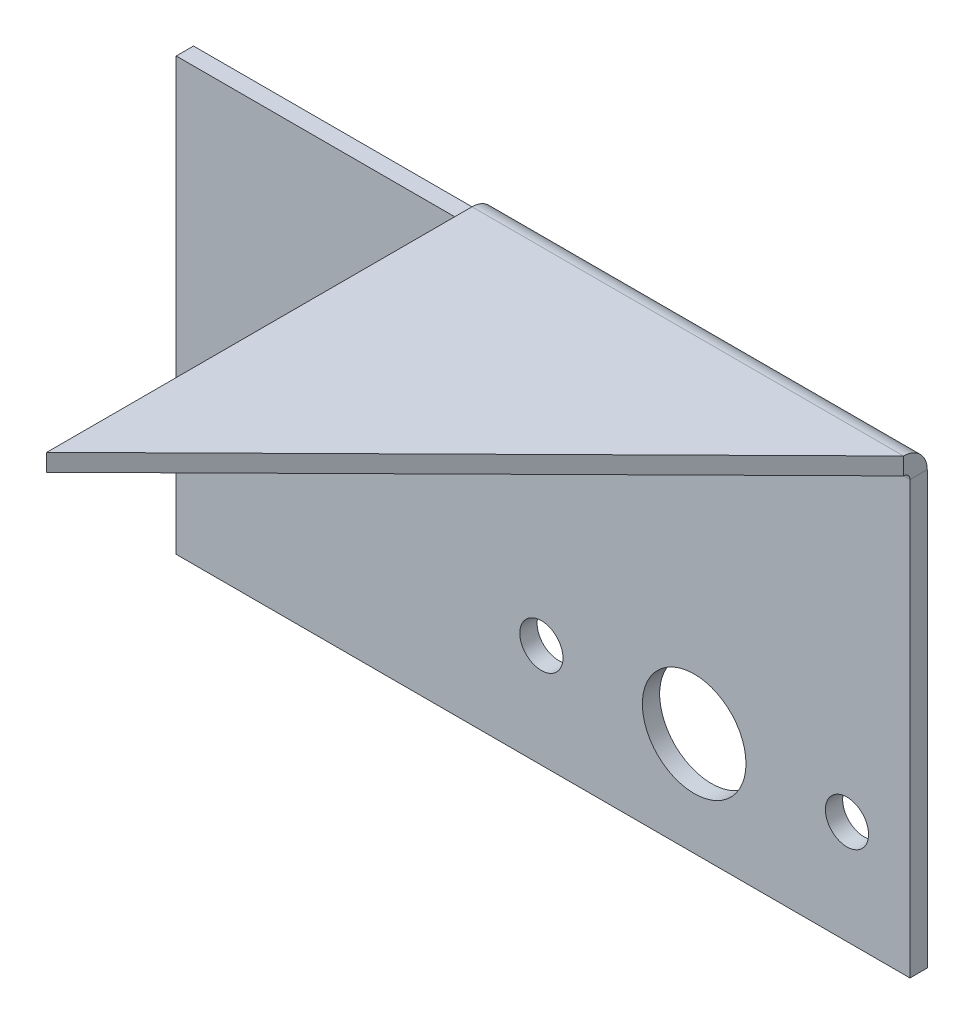
ISO-10303-21;
HEADER;
FILE_DESCRIPTION(('STEP AP214'),'2;1');
FILE_NAME('part.step','',(''),(''),'','','');
FILE_SCHEMA(('AUTOMOTIVE_DESIGN { 1 0 10303 214 1 1 1 1 }'));
ENDSEC;
DATA;
#1=APPLICATION_CONTEXT('core data for automotive mechanical design processes');
#2=APPLICATION_PROTOCOL_DEFINITION('international standard','automotive_design',2000,#1);
#3=PRODUCT_CONTEXT('',#1,'mechanical');
#4=PRODUCT('Part','Part','',(#3));
#5=PRODUCT_RELATED_PRODUCT_CATEGORY('part','',(#4));
#6=PRODUCT_DEFINITION_FORMATION('','',#4);
#7=PRODUCT_DEFINITION_CONTEXT('part definition',#1,'design');
#8=PRODUCT_DEFINITION('design','',#6,#7);
#9=PRODUCT_DEFINITION_SHAPE('','',#8);
#10=(LENGTH_UNIT() NAMED_UNIT(*) SI_UNIT(.MILLI.,.METRE.));
#11=(NAMED_UNIT(*) PLANE_ANGLE_UNIT() SI_UNIT($,.RADIAN.));
#12=(NAMED_UNIT(*) SI_UNIT($,.STERADIAN.) SOLID_ANGLE_UNIT());
#13=UNCERTAINTY_MEASURE_WITH_UNIT(LENGTH_MEASURE(1.E-05),#10,'distance_accuracy_value','');
#14=(GEOMETRIC_REPRESENTATION_CONTEXT(3) GLOBAL_UNCERTAINTY_ASSIGNED_CONTEXT((#13)) GLOBAL_UNIT_ASSIGNED_CONTEXT((#10,
#11,#12)) REPRESENTATION_CONTEXT('',''));
#15=CARTESIAN_POINT('',(0.,0.,0.));
#16=DIRECTION('',(0.,0.,1.));
#17=DIRECTION('',(1.,0.,0.));
#18=AXIS2_PLACEMENT_3D('',#15,#16,#17);
#19=CARTESIAN_POINT('',(-42.5,-25.,-2.));
#20=DIRECTION('',(0.,-1.,0.));
#21=DIRECTION('',(0.,0.,-1.));
#22=AXIS2_PLACEMENT_3D('',#19,#20,#21);
#23=PLANE('',#22);
#24=DIRECTION('',(1.,0.,0.));
#25=VECTOR('',#24,1.);
#26=CARTESIAN_POINT('',(-42.5,-25.,0.));
#27=LINE('',#26,#25);
#28=CARTESIAN_POINT('',(-42.5,-25.,0.));
#29=VERTEX_POINT('',#28);
#30=CARTESIAN_POINT('',(42.5,-25.,0.));
#31=VERTEX_POINT('',#30);
#32=EDGE_CURVE('E206',#29,#31,#27,.T.);
#33=ORIENTED_EDGE('',*,*,#32,.F.);
#34=DIRECTION('',(0.,0.,1.));
#35=VECTOR('',#34,1.);
#36=CARTESIAN_POINT('',(-42.5,-25.,-2.));
#37=LINE('',#36,#35);
#38=CARTESIAN_POINT('',(-42.5,-25.,-2.));
#39=VERTEX_POINT('',#38);
#40=EDGE_CURVE('E105',#39,#29,#37,.T.);
#41=ORIENTED_EDGE('',*,*,#40,.F.);
#42=DIRECTION('',(1.,0.,0.));
#43=VECTOR('',#42,1.);
#44=CARTESIAN_POINT('',(-42.5,-25.,-2.));
#45=LINE('',#44,#43);
#46=CARTESIAN_POINT('',(42.5,-25.,-2.));
#47=VERTEX_POINT('',#46);
#48=EDGE_CURVE('E219',#39,#47,#45,.T.);
#49=ORIENTED_EDGE('',*,*,#48,.T.);
#50=DIRECTION('',(0.,0.,1.));
#51=VECTOR('',#50,1.);
#52=CARTESIAN_POINT('',(42.5,-25.,-2.));
#53=LINE('',#52,#51);
#54=EDGE_CURVE('E217',#47,#31,#53,.T.);
#55=ORIENTED_EDGE('',*,*,#54,.T.);
#56=EDGE_LOOP('',(#33,#41,#49,#55));
#57=FACE_BOUND('',#56,.T.);
#58=ADVANCED_FACE('F81',(#57),#23,.T.);
#59=CARTESIAN_POINT('',(0.,0.,-2.));
#60=DIRECTION('',(0.,0.,-1.));
#61=DIRECTION('',(-1.,0.,0.));
#62=AXIS2_PLACEMENT_3D('',#59,#60,#61);
#63=PLANE('',#62);
#64=CARTESIAN_POINT('',(35.2000000000001,-13.,-2.));
#65=DIRECTION('',(0.,0.,1.));
#66=DIRECTION('',(1.,0.,0.));
#67=AXIS2_PLACEMENT_3D('',#64,#65,#66);
#68=CIRCLE('',#67,2.5);
#69=CARTESIAN_POINT('',(37.7000000000001,-13.,-2.));
#70=VERTEX_POINT('',#69);
#71=EDGE_CURVE('E283',#70,#70,#68,.T.);
#72=ORIENTED_EDGE('',*,*,#71,.T.);
#73=EDGE_LOOP('',(#72));
#74=FACE_BOUND('',#73,.T.);
#75=CARTESIAN_POINT('',(-0.19999999999995,-13.,-2.));
#76=DIRECTION('',(0.,0.,1.));
#77=DIRECTION('',(1.,0.,0.));
#78=AXIS2_PLACEMENT_3D('',#75,#76,#77);
#79=CIRCLE('',#78,2.5);
#80=CARTESIAN_POINT('',(2.30000000000005,-13.,-2.));
#81=VERTEX_POINT('',#80);
#82=EDGE_CURVE('E321',#81,#81,#79,.T.);
#83=ORIENTED_EDGE('',*,*,#82,.T.);
#84=EDGE_LOOP('',(#83));
#85=FACE_BOUND('',#84,.T.);
#86=CARTESIAN_POINT('',(17.5,-13.,-2.));
#87=DIRECTION('',(0.,0.,1.));
#88=DIRECTION('',(1.,0.,0.));
#89=AXIS2_PLACEMENT_3D('',#86,#87,#88);
#90=CIRCLE('',#89,6.);
#91=CARTESIAN_POINT('',(23.5,-13.,-2.));
#92=VERTEX_POINT('',#91);
#93=EDGE_CURVE('E188',#92,#92,#90,.T.);
#94=ORIENTED_EDGE('',*,*,#93,.T.);
#95=EDGE_LOOP('',(#94));
#96=FACE_BOUND('',#95,.T.);
#97=DIRECTION('',(0.,1.,0.));
#98=VECTOR('',#97,1.);
#99=CARTESIAN_POINT('',(42.5,-25.,-2.));
#100=LINE('',#99,#98);
#101=CARTESIAN_POINT('',(42.5,25.,-2.));
#102=VERTEX_POINT('',#101);
#103=EDGE_CURVE('E214',#47,#102,#100,.T.);
#104=ORIENTED_EDGE('',*,*,#103,.F.);
#105=ORIENTED_EDGE('',*,*,#48,.F.);
#106=DIRECTION('',(0.,-1.,0.));
#107=VECTOR('',#106,1.);
#108=CARTESIAN_POINT('',(-42.5,-25.,-2.));
#109=LINE('',#108,#107);
#110=CARTESIAN_POINT('',(-42.5,25.,-2.));
#111=VERTEX_POINT('',#110);
#112=EDGE_CURVE('E204',#111,#39,#109,.T.);
#113=ORIENTED_EDGE('',*,*,#112,.F.);
#114=DIRECTION('',(-1.,0.,0.));
#115=VECTOR('',#114,1.);
#116=CARTESIAN_POINT('',(0.,25.,-2.));
#117=LINE('',#116,#115);
#118=CARTESIAN_POINT('',(-7.49999999999996,25.,-2.));
#119=VERTEX_POINT('',#118);
#120=EDGE_CURVE('E125',#111,#119,#117,.F.);
#121=ORIENTED_EDGE('',*,*,#120,.T.);
#122=DIRECTION('',(-1.,0.,0.));
#123=VECTOR('',#122,1.);
#124=CARTESIAN_POINT('',(-42.5,25.,-2.));
#125=LINE('',#124,#123);
#126=EDGE_CURVE('E203',#102,#119,#125,.T.);
#127=ORIENTED_EDGE('',*,*,#126,.F.);
#128=EDGE_LOOP('',(#104,#105,#113,#121,#127));
#129=FACE_BOUND('',#128,.T.);
#130=ADVANCED_FACE('F240',(#74,#85,#96,#129),#63,.T.);
#131=CARTESIAN_POINT('',(42.5,-25.,-2.));
#132=DIRECTION('',(1.,0.,0.));
#133=DIRECTION('',(0.,0.,-1.));
#134=AXIS2_PLACEMENT_3D('',#131,#132,#133);
#135=PLANE('',#134);
#136=DIRECTION('',(0.,1.,0.));
#137=VECTOR('',#136,1.);
#138=CARTESIAN_POINT('',(42.5,-25.,0.));
#139=LINE('',#138,#137);
#140=CARTESIAN_POINT('',(42.5,25.,0.));
#141=VERTEX_POINT('',#140);
#142=EDGE_CURVE('E211',#31,#141,#139,.T.);
#143=ORIENTED_EDGE('',*,*,#142,.F.);
#144=ORIENTED_EDGE('',*,*,#54,.F.);
#145=ORIENTED_EDGE('',*,*,#103,.T.);
#146=DIRECTION('',(0.,0.,1.));
#147=VECTOR('',#146,1.);
#148=CARTESIAN_POINT('',(42.5,25.,-2.));
#149=LINE('',#148,#147);
#150=EDGE_CURVE('E13',#102,#141,#149,.T.);
#151=ORIENTED_EDGE('',*,*,#150,.T.);
#152=EDGE_LOOP('',(#143,#144,#145,#151));
#153=FACE_BOUND('',#152,.T.);
#154=ADVANCED_FACE('F243',(#153),#135,.T.);
#155=CARTESIAN_POINT('',(0.,0.,0.));
#156=DIRECTION('',(0.,0.,-1.));
#157=DIRECTION('',(-1.,0.,0.));
#158=AXIS2_PLACEMENT_3D('',#155,#156,#157);
#159=PLANE('',#158);
#160=CARTESIAN_POINT('',(35.2000000000001,-13.,0.));
#161=DIRECTION('',(0.,0.,1.));
#162=DIRECTION('',(1.,0.,0.));
#163=AXIS2_PLACEMENT_3D('',#160,#161,#162);
#164=CIRCLE('',#163,2.5);
#165=CARTESIAN_POINT('',(37.7000000000001,-13.,0.));
#166=VERTEX_POINT('',#165);
#167=EDGE_CURVE('E274',#166,#166,#164,.T.);
#168=ORIENTED_EDGE('',*,*,#167,.F.);
#169=EDGE_LOOP('',(#168));
#170=FACE_BOUND('',#169,.T.);
#171=CARTESIAN_POINT('',(-0.19999999999995,-13.,0.));
#172=DIRECTION('',(0.,0.,1.));
#173=DIRECTION('',(1.,0.,0.));
#174=AXIS2_PLACEMENT_3D('',#171,#172,#173);
#175=CIRCLE('',#174,2.5);
#176=CARTESIAN_POINT('',(2.30000000000005,-13.,0.));
#177=VERTEX_POINT('',#176);
#178=EDGE_CURVE('E278',#177,#177,#175,.T.);
#179=ORIENTED_EDGE('',*,*,#178,.F.);
#180=EDGE_LOOP('',(#179));
#181=FACE_BOUND('',#180,.T.);
#182=CARTESIAN_POINT('',(17.5,-13.,0.));
#183=DIRECTION('',(0.,0.,1.));
#184=DIRECTION('',(1.,0.,0.));
#185=AXIS2_PLACEMENT_3D('',#182,#183,#184);
#186=CIRCLE('',#185,6.);
#187=CARTESIAN_POINT('',(23.5,-13.,0.));
#188=VERTEX_POINT('',#187);
#189=EDGE_CURVE('E281',#188,#188,#186,.T.);
#190=ORIENTED_EDGE('',*,*,#189,.F.);
#191=EDGE_LOOP('',(#190));
#192=FACE_BOUND('',#191,.T.);
#193=ORIENTED_EDGE('',*,*,#142,.T.);
#194=DIRECTION('',(-1.,0.,0.));
#195=VECTOR('',#194,1.);
#196=CARTESIAN_POINT('',(-42.5,25.,0.));
#197=LINE('',#196,#195);
#198=CARTESIAN_POINT('',(-7.49999999999996,25.,0.));
#199=VERTEX_POINT('',#198);
#200=EDGE_CURVE('E89',#141,#199,#197,.T.);
#201=ORIENTED_EDGE('',*,*,#200,.T.);
#202=DIRECTION('',(1.,0.,0.));
#203=VECTOR('',#202,1.);
#204=CARTESIAN_POINT('',(0.,25.,0.));
#205=LINE('',#204,#203);
#206=CARTESIAN_POINT('',(-42.5,25.,0.));
#207=VERTEX_POINT('',#206);
#208=EDGE_CURVE('E199',#207,#199,#205,.T.);
#209=ORIENTED_EDGE('',*,*,#208,.F.);
#210=DIRECTION('',(0.,-1.,0.));
#211=VECTOR('',#210,1.);
#212=CARTESIAN_POINT('',(-42.5,-25.,0.));
#213=LINE('',#212,#211);
#214=EDGE_CURVE('E209',#207,#29,#213,.T.);
#215=ORIENTED_EDGE('',*,*,#214,.T.);
#216=ORIENTED_EDGE('',*,*,#32,.T.);
#217=EDGE_LOOP('',(#193,#201,#209,#215,#216));
#218=FACE_BOUND('',#217,.T.);
#219=ADVANCED_FACE('F226',(#170,#181,#192,#218),#159,.F.);
#220=CARTESIAN_POINT('',(-42.5,-25.,-2.));
#221=DIRECTION('',(-1.,0.,0.));
#222=DIRECTION('',(0.,0.,1.));
#223=AXIS2_PLACEMENT_3D('',#220,#221,#222);
#224=PLANE('',#223);
#225=ORIENTED_EDGE('',*,*,#214,.F.);
#226=DIRECTION('',(0.,0.,1.));
#227=VECTOR('',#226,1.);
#228=CARTESIAN_POINT('',(-42.5,25.,-2.));
#229=LINE('',#228,#227);
#230=EDGE_CURVE('E130',#111,#207,#229,.T.);
#231=ORIENTED_EDGE('',*,*,#230,.F.);
#232=ORIENTED_EDGE('',*,*,#112,.T.);
#233=ORIENTED_EDGE('',*,*,#40,.T.);
#234=EDGE_LOOP('',(#225,#231,#232,#233));
#235=FACE_BOUND('',#234,.T.);
#236=ADVANCED_FACE('F83',(#235),#224,.T.);
#237=CARTESIAN_POINT('',(0.,25.,0.));
#238=DIRECTION('',(0.,1.,0.));
#239=DIRECTION('',(1.,0.,0.));
#240=AXIS2_PLACEMENT_3D('',#237,#238,#239);
#241=PLANE('',#240);
#242=ORIENTED_EDGE('',*,*,#230,.T.);
#243=ORIENTED_EDGE('',*,*,#208,.T.);
#244=DIRECTION('',(0.,0.,-1.));
#245=VECTOR('',#244,1.);
#246=CARTESIAN_POINT('',(-7.49999999999997,25.,0.));
#247=LINE('',#246,#245);
#248=EDGE_CURVE('E223',#199,#119,#247,.T.);
#249=ORIENTED_EDGE('',*,*,#248,.T.);
#250=ORIENTED_EDGE('',*,*,#120,.F.);
#251=EDGE_LOOP('',(#242,#243,#249,#250));
#252=FACE_BOUND('',#251,.T.);
#253=ADVANCED_FACE('F233',(#252),#241,.T.);
#254=CARTESIAN_POINT('',(-7.49999999999997,25.,0.7366));
#255=DIRECTION('',(-1.,0.,0.));
#256=DIRECTION('',(0.,0.,1.));
#257=AXIS2_PLACEMENT_3D('',#254,#255,#256);
#258=PLANE('',#257);
#259=ORIENTED_EDGE('',*,*,#248,.F.);
#260=CARTESIAN_POINT('',(-7.49999999999996,25.,0.7366));
#261=DIRECTION('',(1.,0.,0.));
#262=DIRECTION('',(0.,0.,-1.));
#263=AXIS2_PLACEMENT_3D('',#260,#261,#262);
#264=CIRCLE('',#263,0.7366);
#265=CARTESIAN_POINT('',(-7.49999999999997,25.7366,0.73659999999998));
#266=VERTEX_POINT('',#265);
#267=EDGE_CURVE('E195',#199,#266,#264,.T.);
#268=ORIENTED_EDGE('',*,*,#267,.T.);
#269=DIRECTION('',(0.,1.,0.));
#270=VECTOR('',#269,1.);
#271=CARTESIAN_POINT('',(-7.49999999999997,25.7366,0.73659999999998));
#272=LINE('',#271,#270);
#273=CARTESIAN_POINT('',(-7.49999999999997,27.7366,0.736599999999973));
#274=VERTEX_POINT('',#273);
#275=EDGE_CURVE('E180',#266,#274,#272,.T.);
#276=ORIENTED_EDGE('',*,*,#275,.T.);
#277=CARTESIAN_POINT('',(-7.49999999999997,25.,0.7366));
#278=DIRECTION('',(1.,0.,0.));
#279=DIRECTION('',(0.,0.,-1.));
#280=AXIS2_PLACEMENT_3D('',#277,#278,#279);
#281=CIRCLE('',#280,2.7366);
#282=EDGE_CURVE('E189',#119,#274,#281,.T.);
#283=ORIENTED_EDGE('',*,*,#282,.F.);
#284=EDGE_LOOP('',(#259,#268,#276,#283));
#285=FACE_BOUND('',#284,.T.);
#286=ADVANCED_FACE('F235',(#285),#258,.T.);
#287=CARTESIAN_POINT('',(42.5,25.,0.7366));
#288=DIRECTION('',(1.,0.,0.));
#289=DIRECTION('',(0.,0.,-1.));
#290=AXIS2_PLACEMENT_3D('',#287,#288,#289);
#291=PLANE('',#290);
#292=CARTESIAN_POINT('',(42.5,25.,0.7366));
#293=DIRECTION('',(1.,0.,0.));
#294=DIRECTION('',(0.,0.,-1.));
#295=AXIS2_PLACEMENT_3D('',#292,#293,#294);
#296=CIRCLE('',#295,0.7366);
#297=CARTESIAN_POINT('',(42.5,25.7366,0.736600000000011));
#298=VERTEX_POINT('',#297);
#299=EDGE_CURVE('E96',#298,#141,#296,.F.);
#300=ORIENTED_EDGE('',*,*,#299,.T.);
#301=ORIENTED_EDGE('',*,*,#150,.F.);
#302=CARTESIAN_POINT('',(42.5,25.,0.7366));
#303=DIRECTION('',(-1.,0.,0.));
#304=DIRECTION('',(0.,0.,1.));
#305=AXIS2_PLACEMENT_3D('',#302,#303,#304);
#306=CIRCLE('',#305,2.7366);
#307=CARTESIAN_POINT('',(42.5,27.7366,0.736600000000016));
#308=VERTEX_POINT('',#307);
#309=EDGE_CURVE('E192',#308,#102,#306,.T.);
#310=ORIENTED_EDGE('',*,*,#309,.F.);
#311=DIRECTION('',(0.,1.,0.));
#312=VECTOR('',#311,1.);
#313=CARTESIAN_POINT('',(42.5,27.7366,0.736600000000004));
#314=LINE('',#313,#312);
#315=EDGE_CURVE('E179',#298,#308,#314,.T.);
#316=ORIENTED_EDGE('',*,*,#315,.F.);
#317=EDGE_LOOP('',(#300,#301,#310,#316));
#318=FACE_BOUND('',#317,.T.);
#319=ADVANCED_FACE('F245',(#318),#291,.T.);
#320=CARTESIAN_POINT('',(-32.6142807770851,25.,0.7366));
#321=DIRECTION('',(1.,0.,0.));
#322=DIRECTION('',(0.,0.,-1.));
#323=AXIS2_PLACEMENT_3D('',#320,#321,#322);
#324=CYLINDRICAL_SURFACE('',#323,2.7366);
#325=DIRECTION('',(1.,0.,0.));
#326=VECTOR('',#325,1.);
#327=CARTESIAN_POINT('',(42.5,27.7366,0.736600000000004));
#328=LINE('',#327,#326);
#329=EDGE_CURVE('E175',#274,#308,#328,.T.);
#330=ORIENTED_EDGE('',*,*,#329,.T.);
#331=ORIENTED_EDGE('',*,*,#309,.T.);
#332=ORIENTED_EDGE('',*,*,#126,.T.);
#333=ORIENTED_EDGE('',*,*,#282,.T.);
#334=EDGE_LOOP('',(#330,#331,#332,#333));
#335=FACE_BOUND('',#334,.T.);
#336=ADVANCED_FACE('F246',(#335),#324,.T.);
#337=CARTESIAN_POINT('',(-32.6142807770851,25.,0.7366));
#338=DIRECTION('',(1.,0.,0.));
#339=DIRECTION('',(0.,0.,-1.));
#340=AXIS2_PLACEMENT_3D('',#337,#338,#339);
#341=CYLINDRICAL_SURFACE('',#340,0.7366);
#342=DIRECTION('',(-1.,0.,0.));
#343=VECTOR('',#342,1.);
#344=CARTESIAN_POINT('',(42.5,25.7366,0.736600000000011));
#345=LINE('',#344,#343);
#346=EDGE_CURVE('E182',#298,#266,#345,.T.);
#347=ORIENTED_EDGE('',*,*,#346,.T.);
#348=ORIENTED_EDGE('',*,*,#267,.F.);
#349=ORIENTED_EDGE('',*,*,#200,.F.);
#350=ORIENTED_EDGE('',*,*,#299,.F.);
#351=EDGE_LOOP('',(#347,#348,#349,#350));
#352=FACE_BOUND('',#351,.T.);
#353=ADVANCED_FACE('F230',(#352),#341,.F.);
#354=CARTESIAN_POINT('',(0.,27.7366,0.));
#355=DIRECTION('',(0.,-1.,0.));
#356=DIRECTION('',(0.,0.,-1.));
#357=AXIS2_PLACEMENT_3D('',#354,#355,#356);
#358=PLANE('',#357);
#359=DIRECTION('',(0.,0.,-1.));
#360=VECTOR('',#359,1.);
#361=CARTESIAN_POINT('',(-7.49999999999998,27.7366,0.));
#362=LINE('',#361,#360);
#363=CARTESIAN_POINT('',(-7.49999999999998,27.7366000000002,50.));
#364=VERTEX_POINT('',#363);
#365=EDGE_CURVE('E163',#364,#274,#362,.T.);
#366=ORIENTED_EDGE('',*,*,#365,.F.);
#367=DIRECTION('',(0.712334368103049,0.,-0.701840258192155));
#368=VECTOR('',#367,1.);
#369=CARTESIAN_POINT('',(34.7970349582967,27.7366,8.32608496070898));
#370=LINE('',#369,#368);
#371=EDGE_CURVE('E169',#364,#308,#370,.T.);
#372=ORIENTED_EDGE('',*,*,#371,.T.);
#373=ORIENTED_EDGE('',*,*,#329,.F.);
#374=EDGE_LOOP('',(#366,#372,#373));
#375=FACE_BOUND('',#374,.T.);
#376=ADVANCED_FACE('F173',(#375),#358,.F.);
#377=CARTESIAN_POINT('',(-7.49999999999997,25.7366000000001,-26.991244901112));
#378=DIRECTION('',(-1.,0.,0.));
#379=DIRECTION('',(0.,0.,-1.));
#380=AXIS2_PLACEMENT_3D('',#377,#378,#379);
#381=PLANE('',#380);
#382=ORIENTED_EDGE('',*,*,#275,.F.);
#383=DIRECTION('',(0.,0.,-1.));
#384=VECTOR('',#383,1.);
#385=CARTESIAN_POINT('',(-7.49999999999997,25.7366000000001,-26.991244901112));
#386=LINE('',#385,#384);
#387=CARTESIAN_POINT('',(-7.49999999999998,25.7365999999998,50.));
#388=VERTEX_POINT('',#387);
#389=EDGE_CURVE('E165',#388,#266,#386,.T.);
#390=ORIENTED_EDGE('',*,*,#389,.F.);
#391=DIRECTION('',(0.,-1.,0.));
#392=VECTOR('',#391,1.);
#393=CARTESIAN_POINT('',(-7.49999999999998,25.7365999999998,50.));
#394=LINE('',#393,#392);
#395=EDGE_CURVE('E159',#388,#364,#394,.F.);
#396=ORIENTED_EDGE('',*,*,#395,.T.);
#397=ORIENTED_EDGE('',*,*,#365,.T.);
#398=EDGE_LOOP('',(#382,#390,#396,#397));
#399=FACE_BOUND('',#398,.T.);
#400=ADVANCED_FACE('F162',(#399),#381,.T.);
#401=CARTESIAN_POINT('',(0.,25.7366,0.));
#402=DIRECTION('',(0.,-1.,0.));
#403=DIRECTION('',(0.,0.,-1.));
#404=AXIS2_PLACEMENT_3D('',#401,#402,#403);
#405=PLANE('',#404);
#406=DIRECTION('',(0.712334368103049,0.,-0.701840258192155));
#407=VECTOR('',#406,1.);
#408=CARTESIAN_POINT('',(34.7970349582967,25.7366,8.32608496070899));
#409=LINE('',#408,#407);
#410=EDGE_CURVE('E292',#388,#298,#409,.T.);
#411=ORIENTED_EDGE('',*,*,#410,.F.);
#412=ORIENTED_EDGE('',*,*,#389,.T.);
#413=ORIENTED_EDGE('',*,*,#346,.F.);
#414=EDGE_LOOP('',(#411,#412,#413));
#415=FACE_BOUND('',#414,.T.);
#416=ADVANCED_FACE('F295',(#415),#405,.T.);
#417=CARTESIAN_POINT('',(34.7970349582967,25.7366,8.32608496070899));
#418=DIRECTION('',(-0.701840258192155,0.,-0.712334368103049));
#419=DIRECTION('',(0.712334368103049,0.,-0.701840258192155));
#420=AXIS2_PLACEMENT_3D('',#417,#418,#419);
#421=PLANE('',#420);
#422=ORIENTED_EDGE('',*,*,#410,.T.);
#423=ORIENTED_EDGE('',*,*,#315,.T.);
#424=ORIENTED_EDGE('',*,*,#371,.F.);
#425=ORIENTED_EDGE('',*,*,#395,.F.);
#426=EDGE_LOOP('',(#422,#423,#424,#425));
#427=FACE_BOUND('',#426,.T.);
#428=ADVANCED_FACE('F178',(#427),#421,.F.);
#429=CARTESIAN_POINT('',(17.5,-13.,-2.));
#430=DIRECTION('',(0.,0.,1.));
#431=DIRECTION('',(1.,0.,0.));
#432=AXIS2_PLACEMENT_3D('',#429,#430,#431);
#433=CYLINDRICAL_SURFACE('',#432,6.);
#434=ORIENTED_EDGE('',*,*,#93,.F.);
#435=EDGE_LOOP('',(#434));
#436=FACE_BOUND('',#435,.T.);
#437=ORIENTED_EDGE('',*,*,#189,.T.);
#438=EDGE_LOOP('',(#437));
#439=FACE_BOUND('',#438,.T.);
#440=ADVANCED_FACE('F302',(#436,#439),#433,.F.);
#441=CARTESIAN_POINT('',(-0.19999999999995,-13.,-2.));
#442=DIRECTION('',(0.,0.,1.));
#443=DIRECTION('',(1.,0.,0.));
#444=AXIS2_PLACEMENT_3D('',#441,#442,#443);
#445=CYLINDRICAL_SURFACE('',#444,2.5);
#446=ORIENTED_EDGE('',*,*,#82,.F.);
#447=EDGE_LOOP('',(#446));
#448=FACE_BOUND('',#447,.T.);
#449=ORIENTED_EDGE('',*,*,#178,.T.);
#450=EDGE_LOOP('',(#449));
#451=FACE_BOUND('',#450,.T.);
#452=ADVANCED_FACE('F309',(#448,#451),#445,.F.);
#453=CARTESIAN_POINT('',(35.2000000000001,-13.,-2.));
#454=DIRECTION('',(0.,0.,1.));
#455=DIRECTION('',(1.,0.,0.));
#456=AXIS2_PLACEMENT_3D('',#453,#454,#455);
#457=CYLINDRICAL_SURFACE('',#456,2.5);
#458=ORIENTED_EDGE('',*,*,#71,.F.);
#459=EDGE_LOOP('',(#458));
#460=FACE_BOUND('',#459,.T.);
#461=ORIENTED_EDGE('',*,*,#167,.T.);
#462=EDGE_LOOP('',(#461));
#463=FACE_BOUND('',#462,.T.);
#464=ADVANCED_FACE('F313',(#460,#463),#457,.F.);
#465=CLOSED_SHELL('',(#58,#130,#154,#219,#236,#253,#286,#319,#336,#353,#376,#400,#416,#428,#440,
#452,#464));
#466=MANIFOLD_SOLID_BREP('B2',#465);
#467=ADVANCED_BREP_SHAPE_REPRESENTATION('',(#18,#466),#14);
#468=SHAPE_DEFINITION_REPRESENTATION(#9,#467);
ENDSEC;
END-ISO-10303-21;
